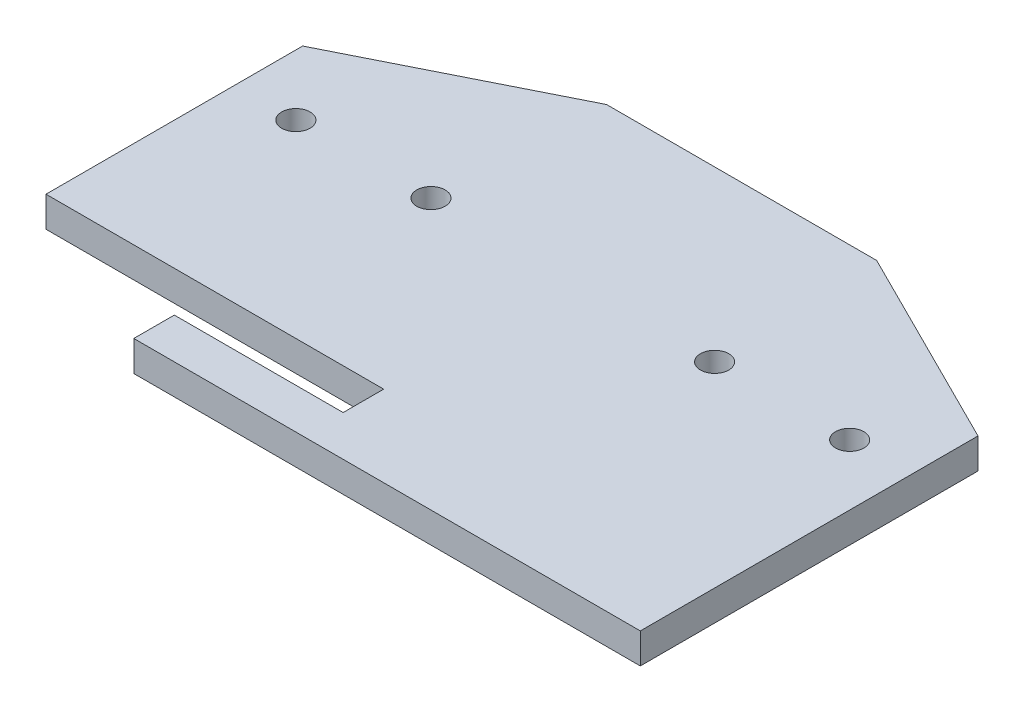
ISO-10303-21;
HEADER;
FILE_DESCRIPTION(('STEP AP214'),'2;1');
FILE_NAME('part.step','',(''),(''),'','','');
FILE_SCHEMA(('AUTOMOTIVE_DESIGN { 1 0 10303 214 1 1 1 1 }'));
ENDSEC;
DATA;
#1=APPLICATION_CONTEXT('core data for automotive mechanical design processes');
#2=APPLICATION_PROTOCOL_DEFINITION('international standard','automotive_design',2000,#1);
#3=PRODUCT_CONTEXT('',#1,'mechanical');
#4=PRODUCT('Part','Part','',(#3));
#5=PRODUCT_RELATED_PRODUCT_CATEGORY('part','',(#4));
#6=PRODUCT_DEFINITION_FORMATION('','',#4);
#7=PRODUCT_DEFINITION_CONTEXT('part definition',#1,'design');
#8=PRODUCT_DEFINITION('design','',#6,#7);
#9=PRODUCT_DEFINITION_SHAPE('','',#8);
#10=(LENGTH_UNIT() NAMED_UNIT(*) SI_UNIT(.MILLI.,.METRE.));
#11=(NAMED_UNIT(*) PLANE_ANGLE_UNIT() SI_UNIT($,.RADIAN.));
#12=(NAMED_UNIT(*) SI_UNIT($,.STERADIAN.) SOLID_ANGLE_UNIT());
#13=UNCERTAINTY_MEASURE_WITH_UNIT(LENGTH_MEASURE(1.E-05),#10,'distance_accuracy_value','');
#14=(GEOMETRIC_REPRESENTATION_CONTEXT(3) GLOBAL_UNCERTAINTY_ASSIGNED_CONTEXT((#13)) GLOBAL_UNIT_ASSIGNED_CONTEXT((#10,
#11,#12)) REPRESENTATION_CONTEXT('',''));
#15=CARTESIAN_POINT('',(0.,0.,0.));
#16=DIRECTION('',(0.,0.,1.));
#17=DIRECTION('',(1.,0.,0.));
#18=AXIS2_PLACEMENT_3D('',#15,#16,#17);
#19=CARTESIAN_POINT('',(0.,4.5,0.));
#20=DIRECTION('',(0.,1.,0.));
#21=DIRECTION('',(0.,0.,1.));
#22=AXIS2_PLACEMENT_3D('',#19,#20,#21);
#23=PLANE('',#22);
#24=DIRECTION('',(-1.,0.,0.));
#25=VECTOR('',#24,1.);
#26=CARTESIAN_POINT('',(-50.,4.5,13.));
#27=LINE('',#26,#25);
#28=CARTESIAN_POINT('',(0.,4.5,13.));
#29=VERTEX_POINT('',#28);
#30=CARTESIAN_POINT('',(-50.,4.5,13.));
#31=VERTEX_POINT('',#30);
#32=EDGE_CURVE('E170',#29,#31,#27,.T.);
#33=ORIENTED_EDGE('',*,*,#32,.F.);
#34=DIRECTION('',(0.,0.,-1.));
#35=VECTOR('',#34,1.);
#36=CARTESIAN_POINT('',(0.,4.5,19.));
#37=LINE('',#36,#35);
#38=CARTESIAN_POINT('',(0.,4.5,19.));
#39=VERTEX_POINT('',#38);
#40=EDGE_CURVE('E175',#39,#29,#37,.T.);
#41=ORIENTED_EDGE('',*,*,#40,.F.);
#42=DIRECTION('',(1.,0.,0.));
#43=VECTOR('',#42,1.);
#44=CARTESIAN_POINT('',(-25.,4.5,19.));
#45=LINE('',#44,#43);
#46=CARTESIAN_POINT('',(-25.,4.5,19.));
#47=VERTEX_POINT('',#46);
#48=EDGE_CURVE('E235',#47,#39,#45,.T.);
#49=ORIENTED_EDGE('',*,*,#48,.F.);
#50=DIRECTION('',(0.,0.,-1.));
#51=VECTOR('',#50,1.);
#52=CARTESIAN_POINT('',(-25.,4.5,25.));
#53=LINE('',#52,#51);
#54=CARTESIAN_POINT('',(-25.,4.5,25.));
#55=VERTEX_POINT('',#54);
#56=EDGE_CURVE('E168',#55,#47,#53,.T.);
#57=ORIENTED_EDGE('',*,*,#56,.F.);
#58=DIRECTION('',(1.,0.,0.));
#59=VECTOR('',#58,1.);
#60=CARTESIAN_POINT('',(-50.,4.5,25.));
#61=LINE('',#60,#59);
#62=CARTESIAN_POINT('',(50.,4.5,25.));
#63=VERTEX_POINT('',#62);
#64=EDGE_CURVE('E56',#55,#63,#61,.T.);
#65=ORIENTED_EDGE('',*,*,#64,.T.);
#66=DIRECTION('',(0.,0.,-1.));
#67=VECTOR('',#66,1.);
#68=CARTESIAN_POINT('',(50.,4.5,-25.));
#69=LINE('',#68,#67);
#70=CARTESIAN_POINT('',(50.,4.5,-25.));
#71=VERTEX_POINT('',#70);
#72=EDGE_CURVE('E139',#63,#71,#69,.T.);
#73=ORIENTED_EDGE('',*,*,#72,.T.);
#74=DIRECTION('',(-0.894427190999916,0.,-0.447213595499958));
#75=VECTOR('',#74,1.);
#76=CARTESIAN_POINT('',(20.,4.5,-40.));
#77=LINE('',#76,#75);
#78=CARTESIAN_POINT('',(20.,4.5,-40.));
#79=VERTEX_POINT('',#78);
#80=EDGE_CURVE('E89',#71,#79,#77,.T.);
#81=ORIENTED_EDGE('',*,*,#80,.T.);
#82=DIRECTION('',(-1.,0.,0.));
#83=VECTOR('',#82,1.);
#84=CARTESIAN_POINT('',(0.,4.5,-40.));
#85=LINE('',#84,#83);
#86=CARTESIAN_POINT('',(-20.,4.5,-40.));
#87=VERTEX_POINT('',#86);
#88=EDGE_CURVE('E95',#79,#87,#85,.T.);
#89=ORIENTED_EDGE('',*,*,#88,.T.);
#90=DIRECTION('',(-0.894427190999916,0.,0.447213595499958));
#91=VECTOR('',#90,1.);
#92=CARTESIAN_POINT('',(-20.,4.5,-40.));
#93=LINE('',#92,#91);
#94=CARTESIAN_POINT('',(-50.,4.5,-25.));
#95=VERTEX_POINT('',#94);
#96=EDGE_CURVE('E101',#87,#95,#93,.T.);
#97=ORIENTED_EDGE('',*,*,#96,.T.);
#98=DIRECTION('',(0.,0.,1.));
#99=VECTOR('',#98,1.);
#100=CARTESIAN_POINT('',(-50.,4.5,-25.));
#101=LINE('',#100,#99);
#102=EDGE_CURVE('E118',#95,#31,#101,.T.);
#103=ORIENTED_EDGE('',*,*,#102,.T.);
#104=EDGE_LOOP('',(#33,#41,#49,#57,#65,#73,#81,#89,#97,#103));
#105=FACE_BOUND('',#104,.T.);
#106=CARTESIAN_POINT('',(-21.,4.5,-15.));
#107=DIRECTION('',(0.,1.,0.));
#108=DIRECTION('',(0.,0.,1.));
#109=AXIS2_PLACEMENT_3D('',#106,#107,#108);
#110=CIRCLE('',#109,2.1);
#111=CARTESIAN_POINT('',(-21.,4.5,-12.9));
#112=VERTEX_POINT('',#111);
#113=EDGE_CURVE('E190',#112,#112,#110,.T.);
#114=ORIENTED_EDGE('',*,*,#113,.F.);
#115=EDGE_LOOP('',(#114));
#116=FACE_BOUND('',#115,.T.);
#117=CARTESIAN_POINT('',(-41.,4.5,-15.));
#118=DIRECTION('',(0.,1.,0.));
#119=DIRECTION('',(0.,0.,1.));
#120=AXIS2_PLACEMENT_3D('',#117,#118,#119);
#121=CIRCLE('',#120,2.1);
#122=CARTESIAN_POINT('',(-41.,4.5,-12.9));
#123=VERTEX_POINT('',#122);
#124=EDGE_CURVE('E129',#123,#123,#121,.T.);
#125=ORIENTED_EDGE('',*,*,#124,.F.);
#126=EDGE_LOOP('',(#125));
#127=FACE_BOUND('',#126,.T.);
#128=CARTESIAN_POINT('',(41.,4.5,-15.));
#129=DIRECTION('',(0.,1.,0.));
#130=DIRECTION('',(0.,0.,1.));
#131=AXIS2_PLACEMENT_3D('',#128,#129,#130);
#132=CIRCLE('',#131,2.1);
#133=CARTESIAN_POINT('',(41.,4.5,-12.9));
#134=VERTEX_POINT('',#133);
#135=EDGE_CURVE('E196',#134,#134,#132,.T.);
#136=ORIENTED_EDGE('',*,*,#135,.F.);
#137=EDGE_LOOP('',(#136));
#138=FACE_BOUND('',#137,.T.);
#139=CARTESIAN_POINT('',(21.,4.5,-15.));
#140=DIRECTION('',(0.,1.,0.));
#141=DIRECTION('',(0.,0.,1.));
#142=AXIS2_PLACEMENT_3D('',#139,#140,#141);
#143=CIRCLE('',#142,2.1);
#144=CARTESIAN_POINT('',(21.,4.5,-12.9));
#145=VERTEX_POINT('',#144);
#146=EDGE_CURVE('E184',#145,#145,#143,.T.);
#147=ORIENTED_EDGE('',*,*,#146,.F.);
#148=EDGE_LOOP('',(#147));
#149=FACE_BOUND('',#148,.T.);
#150=ADVANCED_FACE('F32',(#105,#116,#127,#138,#149),#23,.T.);
#151=CARTESIAN_POINT('',(0.,0.,0.));
#152=DIRECTION('',(0.,1.,0.));
#153=DIRECTION('',(0.,0.,1.));
#154=AXIS2_PLACEMENT_3D('',#151,#152,#153);
#155=PLANE('',#154);
#156=CARTESIAN_POINT('',(-21.,0.,-15.));
#157=DIRECTION('',(0.,1.,0.));
#158=DIRECTION('',(0.,0.,1.));
#159=AXIS2_PLACEMENT_3D('',#156,#157,#158);
#160=CIRCLE('',#159,2.1);
#161=CARTESIAN_POINT('',(-21.,0.,-12.9));
#162=VERTEX_POINT('',#161);
#163=EDGE_CURVE('E187',#162,#162,#160,.T.);
#164=ORIENTED_EDGE('',*,*,#163,.T.);
#165=EDGE_LOOP('',(#164));
#166=FACE_BOUND('',#165,.T.);
#167=CARTESIAN_POINT('',(-41.,0.,-15.));
#168=DIRECTION('',(0.,1.,0.));
#169=DIRECTION('',(0.,0.,1.));
#170=AXIS2_PLACEMENT_3D('',#167,#168,#169);
#171=CIRCLE('',#170,2.1);
#172=CARTESIAN_POINT('',(-41.,0.,-12.9));
#173=VERTEX_POINT('',#172);
#174=EDGE_CURVE('E199',#173,#173,#171,.T.);
#175=ORIENTED_EDGE('',*,*,#174,.T.);
#176=EDGE_LOOP('',(#175));
#177=FACE_BOUND('',#176,.T.);
#178=DIRECTION('',(0.,0.,-1.));
#179=VECTOR('',#178,1.);
#180=CARTESIAN_POINT('',(0.,0.,0.));
#181=LINE('',#180,#179);
#182=CARTESIAN_POINT('',(0.,0.,19.));
#183=VERTEX_POINT('',#182);
#184=CARTESIAN_POINT('',(0.,0.,13.));
#185=VERTEX_POINT('',#184);
#186=EDGE_CURVE('E11',#183,#185,#181,.T.);
#187=ORIENTED_EDGE('',*,*,#186,.T.);
#188=DIRECTION('',(-1.,0.,0.));
#189=VECTOR('',#188,1.);
#190=CARTESIAN_POINT('',(0.,0.,13.));
#191=LINE('',#190,#189);
#192=CARTESIAN_POINT('',(-50.,0.,13.));
#193=VERTEX_POINT('',#192);
#194=EDGE_CURVE('E180',#185,#193,#191,.T.);
#195=ORIENTED_EDGE('',*,*,#194,.T.);
#196=DIRECTION('',(0.,0.,1.));
#197=VECTOR('',#196,1.);
#198=CARTESIAN_POINT('',(-50.,0.,-25.));
#199=LINE('',#198,#197);
#200=CARTESIAN_POINT('',(-50.,0.,-25.));
#201=VERTEX_POINT('',#200);
#202=EDGE_CURVE('E135',#201,#193,#199,.T.);
#203=ORIENTED_EDGE('',*,*,#202,.F.);
#204=DIRECTION('',(-0.894427190999916,0.,0.447213595499958));
#205=VECTOR('',#204,1.);
#206=CARTESIAN_POINT('',(-20.,0.,-40.));
#207=LINE('',#206,#205);
#208=CARTESIAN_POINT('',(-20.,0.,-40.));
#209=VERTEX_POINT('',#208);
#210=EDGE_CURVE('E133',#209,#201,#207,.T.);
#211=ORIENTED_EDGE('',*,*,#210,.F.);
#212=DIRECTION('',(-1.,0.,0.));
#213=VECTOR('',#212,1.);
#214=CARTESIAN_POINT('',(0.,0.,-40.));
#215=LINE('',#214,#213);
#216=CARTESIAN_POINT('',(20.,0.,-40.));
#217=VERTEX_POINT('',#216);
#218=EDGE_CURVE('E109',#217,#209,#215,.T.);
#219=ORIENTED_EDGE('',*,*,#218,.F.);
#220=DIRECTION('',(-0.894427190999916,0.,-0.447213595499958));
#221=VECTOR('',#220,1.);
#222=CARTESIAN_POINT('',(20.,0.,-40.));
#223=LINE('',#222,#221);
#224=CARTESIAN_POINT('',(50.,0.,-25.));
#225=VERTEX_POINT('',#224);
#226=EDGE_CURVE('E128',#225,#217,#223,.T.);
#227=ORIENTED_EDGE('',*,*,#226,.F.);
#228=DIRECTION('',(0.,0.,-1.));
#229=VECTOR('',#228,1.);
#230=CARTESIAN_POINT('',(50.,0.,-25.));
#231=LINE('',#230,#229);
#232=CARTESIAN_POINT('',(50.,0.,25.));
#233=VERTEX_POINT('',#232);
#234=EDGE_CURVE('E125',#233,#225,#231,.T.);
#235=ORIENTED_EDGE('',*,*,#234,.F.);
#236=DIRECTION('',(1.,0.,0.));
#237=VECTOR('',#236,1.);
#238=CARTESIAN_POINT('',(-50.,0.,25.));
#239=LINE('',#238,#237);
#240=CARTESIAN_POINT('',(-25.,0.,25.));
#241=VERTEX_POINT('',#240);
#242=EDGE_CURVE('E80',#241,#233,#239,.T.);
#243=ORIENTED_EDGE('',*,*,#242,.F.);
#244=DIRECTION('',(0.,0.,-1.));
#245=VECTOR('',#244,1.);
#246=CARTESIAN_POINT('',(-25.,0.,0.));
#247=LINE('',#246,#245);
#248=CARTESIAN_POINT('',(-25.,0.,19.));
#249=VERTEX_POINT('',#248);
#250=EDGE_CURVE('E47',#241,#249,#247,.T.);
#251=ORIENTED_EDGE('',*,*,#250,.T.);
#252=DIRECTION('',(1.,0.,0.));
#253=VECTOR('',#252,1.);
#254=CARTESIAN_POINT('',(0.,0.,19.));
#255=LINE('',#254,#253);
#256=EDGE_CURVE('E40',#249,#183,#255,.T.);
#257=ORIENTED_EDGE('',*,*,#256,.T.);
#258=EDGE_LOOP('',(#187,#195,#203,#211,#219,#227,#235,#243,#251,#257));
#259=FACE_BOUND('',#258,.T.);
#260=CARTESIAN_POINT('',(41.,0.,-15.));
#261=DIRECTION('',(0.,1.,0.));
#262=DIRECTION('',(0.,0.,1.));
#263=AXIS2_PLACEMENT_3D('',#260,#261,#262);
#264=CIRCLE('',#263,2.1);
#265=CARTESIAN_POINT('',(41.,0.,-12.9));
#266=VERTEX_POINT('',#265);
#267=EDGE_CURVE('E193',#266,#266,#264,.T.);
#268=ORIENTED_EDGE('',*,*,#267,.T.);
#269=EDGE_LOOP('',(#268));
#270=FACE_BOUND('',#269,.T.);
#271=CARTESIAN_POINT('',(21.,0.,-15.));
#272=DIRECTION('',(0.,1.,0.));
#273=DIRECTION('',(0.,0.,1.));
#274=AXIS2_PLACEMENT_3D('',#271,#272,#273);
#275=CIRCLE('',#274,2.1);
#276=CARTESIAN_POINT('',(21.,0.,-12.9));
#277=VERTEX_POINT('',#276);
#278=EDGE_CURVE('E183',#277,#277,#275,.T.);
#279=ORIENTED_EDGE('',*,*,#278,.T.);
#280=EDGE_LOOP('',(#279));
#281=FACE_BOUND('',#280,.T.);
#282=ADVANCED_FACE('F149',(#166,#177,#259,#270,#281),#155,.F.);
#283=CARTESIAN_POINT('',(50.,4.5,-25.));
#284=DIRECTION('',(-1.,0.,0.));
#285=DIRECTION('',(0.,0.,1.));
#286=AXIS2_PLACEMENT_3D('',#283,#284,#285);
#287=PLANE('',#286);
#288=ORIENTED_EDGE('',*,*,#234,.T.);
#289=DIRECTION('',(0.,-1.,0.));
#290=VECTOR('',#289,1.);
#291=CARTESIAN_POINT('',(50.,4.5,-25.));
#292=LINE('',#291,#290);
#293=EDGE_CURVE('E143',#71,#225,#292,.T.);
#294=ORIENTED_EDGE('',*,*,#293,.F.);
#295=ORIENTED_EDGE('',*,*,#72,.F.);
#296=DIRECTION('',(0.,-1.,0.));
#297=VECTOR('',#296,1.);
#298=CARTESIAN_POINT('',(50.,4.5,25.));
#299=LINE('',#298,#297);
#300=EDGE_CURVE('E124',#63,#233,#299,.T.);
#301=ORIENTED_EDGE('',*,*,#300,.T.);
#302=EDGE_LOOP('',(#288,#294,#295,#301));
#303=FACE_BOUND('',#302,.T.);
#304=ADVANCED_FACE('F34',(#303),#287,.F.);
#305=CARTESIAN_POINT('',(20.,4.5,-40.));
#306=DIRECTION('',(-0.447213595499958,0.,0.894427190999916));
#307=DIRECTION('',(0.894427190999916,0.,0.447213595499958));
#308=AXIS2_PLACEMENT_3D('',#305,#306,#307);
#309=PLANE('',#308);
#310=ORIENTED_EDGE('',*,*,#226,.T.);
#311=DIRECTION('',(0.,-1.,0.));
#312=VECTOR('',#311,1.);
#313=CARTESIAN_POINT('',(20.,4.5,-40.));
#314=LINE('',#313,#312);
#315=EDGE_CURVE('E112',#79,#217,#314,.T.);
#316=ORIENTED_EDGE('',*,*,#315,.F.);
#317=ORIENTED_EDGE('',*,*,#80,.F.);
#318=ORIENTED_EDGE('',*,*,#293,.T.);
#319=EDGE_LOOP('',(#310,#316,#317,#318));
#320=FACE_BOUND('',#319,.T.);
#321=ADVANCED_FACE('F210',(#320),#309,.F.);
#322=CARTESIAN_POINT('',(0.,4.5,-40.));
#323=DIRECTION('',(0.,0.,1.));
#324=DIRECTION('',(1.,0.,0.));
#325=AXIS2_PLACEMENT_3D('',#322,#323,#324);
#326=PLANE('',#325);
#327=ORIENTED_EDGE('',*,*,#218,.T.);
#328=DIRECTION('',(0.,-1.,0.));
#329=VECTOR('',#328,1.);
#330=CARTESIAN_POINT('',(-20.,4.5,-40.));
#331=LINE('',#330,#329);
#332=EDGE_CURVE('E107',#87,#209,#331,.T.);
#333=ORIENTED_EDGE('',*,*,#332,.F.);
#334=ORIENTED_EDGE('',*,*,#88,.F.);
#335=ORIENTED_EDGE('',*,*,#315,.T.);
#336=EDGE_LOOP('',(#327,#333,#334,#335));
#337=FACE_BOUND('',#336,.T.);
#338=ADVANCED_FACE('F108',(#337),#326,.F.);
#339=CARTESIAN_POINT('',(-20.,4.5,-40.));
#340=DIRECTION('',(0.447213595499958,0.,0.894427190999916));
#341=DIRECTION('',(0.894427190999916,0.,-0.447213595499958));
#342=AXIS2_PLACEMENT_3D('',#339,#340,#341);
#343=PLANE('',#342);
#344=ORIENTED_EDGE('',*,*,#210,.T.);
#345=DIRECTION('',(0.,-1.,0.));
#346=VECTOR('',#345,1.);
#347=CARTESIAN_POINT('',(-50.,4.5,-25.));
#348=LINE('',#347,#346);
#349=EDGE_CURVE('E113',#95,#201,#348,.T.);
#350=ORIENTED_EDGE('',*,*,#349,.F.);
#351=ORIENTED_EDGE('',*,*,#96,.F.);
#352=ORIENTED_EDGE('',*,*,#332,.T.);
#353=EDGE_LOOP('',(#344,#350,#351,#352));
#354=FACE_BOUND('',#353,.T.);
#355=ADVANCED_FACE('F115',(#354),#343,.F.);
#356=CARTESIAN_POINT('',(-50.,4.5,-25.));
#357=DIRECTION('',(1.,0.,0.));
#358=DIRECTION('',(0.,0.,-1.));
#359=AXIS2_PLACEMENT_3D('',#356,#357,#358);
#360=PLANE('',#359);
#361=ORIENTED_EDGE('',*,*,#202,.T.);
#362=DIRECTION('',(0.,1.,0.));
#363=VECTOR('',#362,1.);
#364=CARTESIAN_POINT('',(-50.,-5.5,13.));
#365=LINE('',#364,#363);
#366=EDGE_CURVE('E181',#193,#31,#365,.T.);
#367=ORIENTED_EDGE('',*,*,#366,.T.);
#368=ORIENTED_EDGE('',*,*,#102,.F.);
#369=ORIENTED_EDGE('',*,*,#349,.T.);
#370=EDGE_LOOP('',(#361,#367,#368,#369));
#371=FACE_BOUND('',#370,.T.);
#372=ADVANCED_FACE('F213',(#371),#360,.F.);
#373=CARTESIAN_POINT('',(-50.,4.5,25.));
#374=DIRECTION('',(0.,0.,-1.));
#375=DIRECTION('',(-1.,0.,0.));
#376=AXIS2_PLACEMENT_3D('',#373,#374,#375);
#377=PLANE('',#376);
#378=ORIENTED_EDGE('',*,*,#64,.F.);
#379=DIRECTION('',(0.,-1.,0.));
#380=VECTOR('',#379,1.);
#381=CARTESIAN_POINT('',(-25.,4.5,25.));
#382=LINE('',#381,#380);
#383=EDGE_CURVE('E145',#55,#241,#382,.T.);
#384=ORIENTED_EDGE('',*,*,#383,.T.);
#385=ORIENTED_EDGE('',*,*,#242,.T.);
#386=ORIENTED_EDGE('',*,*,#300,.F.);
#387=EDGE_LOOP('',(#378,#384,#385,#386));
#388=FACE_BOUND('',#387,.T.);
#389=ADVANCED_FACE('F240',(#388),#377,.F.);
#390=CARTESIAN_POINT('',(-41.,4.5,-15.));
#391=DIRECTION('',(0.,-1.,0.));
#392=DIRECTION('',(0.,0.,-1.));
#393=AXIS2_PLACEMENT_3D('',#390,#391,#392);
#394=CYLINDRICAL_SURFACE('',#393,2.1);
#395=ORIENTED_EDGE('',*,*,#124,.T.);
#396=EDGE_LOOP('',(#395));
#397=FACE_BOUND('',#396,.T.);
#398=ORIENTED_EDGE('',*,*,#174,.F.);
#399=EDGE_LOOP('',(#398));
#400=FACE_BOUND('',#399,.T.);
#401=ADVANCED_FACE('F242',(#397,#400),#394,.F.);
#402=CARTESIAN_POINT('',(41.,4.5,-15.));
#403=DIRECTION('',(0.,-1.,0.));
#404=DIRECTION('',(0.,0.,-1.));
#405=AXIS2_PLACEMENT_3D('',#402,#403,#404);
#406=CYLINDRICAL_SURFACE('',#405,2.1);
#407=ORIENTED_EDGE('',*,*,#135,.T.);
#408=EDGE_LOOP('',(#407));
#409=FACE_BOUND('',#408,.T.);
#410=ORIENTED_EDGE('',*,*,#267,.F.);
#411=EDGE_LOOP('',(#410));
#412=FACE_BOUND('',#411,.T.);
#413=ADVANCED_FACE('F248',(#409,#412),#406,.F.);
#414=CARTESIAN_POINT('',(-21.,4.5,-15.));
#415=DIRECTION('',(0.,-1.,0.));
#416=DIRECTION('',(0.,0.,-1.));
#417=AXIS2_PLACEMENT_3D('',#414,#415,#416);
#418=CYLINDRICAL_SURFACE('',#417,2.1);
#419=ORIENTED_EDGE('',*,*,#113,.T.);
#420=EDGE_LOOP('',(#419));
#421=FACE_BOUND('',#420,.T.);
#422=ORIENTED_EDGE('',*,*,#163,.F.);
#423=EDGE_LOOP('',(#422));
#424=FACE_BOUND('',#423,.T.);
#425=ADVANCED_FACE('F262',(#421,#424),#418,.F.);
#426=CARTESIAN_POINT('',(21.,4.5,-15.));
#427=DIRECTION('',(0.,-1.,0.));
#428=DIRECTION('',(0.,0.,-1.));
#429=AXIS2_PLACEMENT_3D('',#426,#427,#428);
#430=CYLINDRICAL_SURFACE('',#429,2.1);
#431=ORIENTED_EDGE('',*,*,#146,.T.);
#432=EDGE_LOOP('',(#431));
#433=FACE_BOUND('',#432,.T.);
#434=ORIENTED_EDGE('',*,*,#278,.F.);
#435=EDGE_LOOP('',(#434));
#436=FACE_BOUND('',#435,.T.);
#437=ADVANCED_FACE('F266',(#433,#436),#430,.F.);
#438=CARTESIAN_POINT('',(0.,-5.5,19.));
#439=DIRECTION('',(1.,0.,0.));
#440=DIRECTION('',(0.,0.,-1.));
#441=AXIS2_PLACEMENT_3D('',#438,#439,#440);
#442=PLANE('',#441);
#443=DIRECTION('',(0.,1.,0.));
#444=VECTOR('',#443,1.);
#445=CARTESIAN_POINT('',(0.,-5.5,19.));
#446=LINE('',#445,#444);
#447=EDGE_CURVE('E164',#183,#39,#446,.T.);
#448=ORIENTED_EDGE('',*,*,#447,.T.);
#449=ORIENTED_EDGE('',*,*,#40,.T.);
#450=DIRECTION('',(0.,1.,0.));
#451=VECTOR('',#450,1.);
#452=CARTESIAN_POINT('',(0.,-5.5,13.));
#453=LINE('',#452,#451);
#454=EDGE_CURVE('E172',#185,#29,#453,.T.);
#455=ORIENTED_EDGE('',*,*,#454,.F.);
#456=ORIENTED_EDGE('',*,*,#186,.F.);
#457=EDGE_LOOP('',(#448,#449,#455,#456));
#458=FACE_BOUND('',#457,.T.);
#459=ADVANCED_FACE('F231',(#458),#442,.F.);
#460=CARTESIAN_POINT('',(-25.,-5.5,19.));
#461=DIRECTION('',(0.,0.,1.));
#462=DIRECTION('',(1.,0.,0.));
#463=AXIS2_PLACEMENT_3D('',#460,#461,#462);
#464=PLANE('',#463);
#465=DIRECTION('',(0.,1.,0.));
#466=VECTOR('',#465,1.);
#467=CARTESIAN_POINT('',(-25.,-5.5,19.));
#468=LINE('',#467,#466);
#469=EDGE_CURVE('E161',#249,#47,#468,.T.);
#470=ORIENTED_EDGE('',*,*,#469,.T.);
#471=ORIENTED_EDGE('',*,*,#48,.T.);
#472=ORIENTED_EDGE('',*,*,#447,.F.);
#473=ORIENTED_EDGE('',*,*,#256,.F.);
#474=EDGE_LOOP('',(#470,#471,#472,#473));
#475=FACE_BOUND('',#474,.T.);
#476=ADVANCED_FACE('F158',(#475),#464,.F.);
#477=CARTESIAN_POINT('',(-50.,-5.5,13.));
#478=DIRECTION('',(0.,0.,-1.));
#479=DIRECTION('',(-1.,0.,0.));
#480=AXIS2_PLACEMENT_3D('',#477,#478,#479);
#481=PLANE('',#480);
#482=ORIENTED_EDGE('',*,*,#454,.T.);
#483=ORIENTED_EDGE('',*,*,#32,.T.);
#484=ORIENTED_EDGE('',*,*,#366,.F.);
#485=ORIENTED_EDGE('',*,*,#194,.F.);
#486=EDGE_LOOP('',(#482,#483,#484,#485));
#487=FACE_BOUND('',#486,.T.);
#488=ADVANCED_FACE('F228',(#487),#481,.F.);
#489=CARTESIAN_POINT('',(-25.,-5.5,25.));
#490=DIRECTION('',(1.,0.,0.));
#491=DIRECTION('',(0.,0.,-1.));
#492=AXIS2_PLACEMENT_3D('',#489,#490,#491);
#493=PLANE('',#492);
#494=ORIENTED_EDGE('',*,*,#383,.F.);
#495=ORIENTED_EDGE('',*,*,#56,.T.);
#496=ORIENTED_EDGE('',*,*,#469,.F.);
#497=ORIENTED_EDGE('',*,*,#250,.F.);
#498=EDGE_LOOP('',(#494,#495,#496,#497));
#499=FACE_BOUND('',#498,.T.);
#500=ADVANCED_FACE('F167',(#499),#493,.F.);
#501=CLOSED_SHELL('',(#150,#282,#304,#321,#338,#355,#372,#389,#401,#413,#425,#437,#459,#476,
#488,#500));
#502=MANIFOLD_SOLID_BREP('B2',#501);
#503=ADVANCED_BREP_SHAPE_REPRESENTATION('',(#18,#502),#14);
#504=SHAPE_DEFINITION_REPRESENTATION(#9,#503);
ENDSEC;
END-ISO-10303-21;
